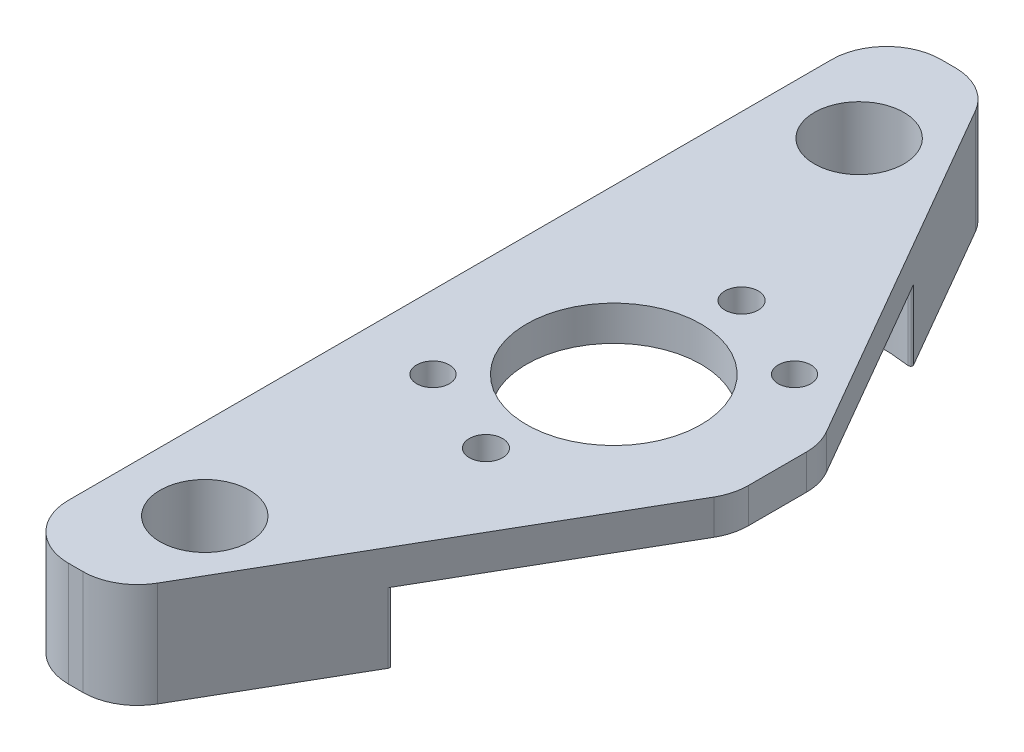
ISO-10303-21;
HEADER;
FILE_DESCRIPTION(('STEP AP214'),'2;1');
FILE_NAME('part.step','',(''),(''),'','','');
FILE_SCHEMA(('AUTOMOTIVE_DESIGN { 1 0 10303 214 1 1 1 1 }'));
ENDSEC;
DATA;
#1=APPLICATION_CONTEXT('core data for automotive mechanical design processes');
#2=APPLICATION_PROTOCOL_DEFINITION('international standard','automotive_design',2000,#1);
#3=PRODUCT_CONTEXT('',#1,'mechanical');
#4=PRODUCT('Part','Part','',(#3));
#5=PRODUCT_RELATED_PRODUCT_CATEGORY('part','',(#4));
#6=PRODUCT_DEFINITION_FORMATION('','',#4);
#7=PRODUCT_DEFINITION_CONTEXT('part definition',#1,'design');
#8=PRODUCT_DEFINITION('design','',#6,#7);
#9=PRODUCT_DEFINITION_SHAPE('','',#8);
#10=(LENGTH_UNIT() NAMED_UNIT(*) SI_UNIT(.MILLI.,.METRE.));
#11=(NAMED_UNIT(*) PLANE_ANGLE_UNIT() SI_UNIT($,.RADIAN.));
#12=(NAMED_UNIT(*) SI_UNIT($,.STERADIAN.) SOLID_ANGLE_UNIT());
#13=UNCERTAINTY_MEASURE_WITH_UNIT(LENGTH_MEASURE(1.E-05),#10,'distance_accuracy_value','');
#14=(GEOMETRIC_REPRESENTATION_CONTEXT(3) GLOBAL_UNCERTAINTY_ASSIGNED_CONTEXT((#13)) GLOBAL_UNIT_ASSIGNED_CONTEXT((#10,
#11,#12)) REPRESENTATION_CONTEXT('',''));
#15=CARTESIAN_POINT('',(0.,0.,0.));
#16=DIRECTION('',(0.,0.,1.));
#17=DIRECTION('',(1.,0.,0.));
#18=AXIS2_PLACEMENT_3D('',#15,#16,#17);
#19=CARTESIAN_POINT('',(0.,4.064,0.));
#20=DIRECTION('',(0.,-1.,0.));
#21=DIRECTION('',(0.,0.,-1.));
#22=AXIS2_PLACEMENT_3D('',#19,#20,#21);
#23=CYLINDRICAL_SURFACE('',#22,15.24);
#24=DIRECTION('',(0.,-1.,0.));
#25=VECTOR('',#24,1.);
#26=CARTESIAN_POINT('',(-9.32033057851238,4.064,12.0577376778253));
#27=LINE('',#26,#25);
#28=CARTESIAN_POINT('',(-9.32033057851238,4.064,12.0577376778253));
#29=VERTEX_POINT('',#28);
#30=CARTESIAN_POINT('',(-9.32033057851238,0.,12.0577376778253));
#31=VERTEX_POINT('',#30);
#32=EDGE_CURVE('E220',#29,#31,#27,.T.);
#33=ORIENTED_EDGE('',*,*,#32,.F.);
#34=CARTESIAN_POINT('',(0.,4.064,0.));
#35=DIRECTION('',(0.,-1.,0.));
#36=DIRECTION('',(0.,0.,-1.));
#37=AXIS2_PLACEMENT_3D('',#34,#35,#36);
#38=CIRCLE('',#37,15.24);
#39=CARTESIAN_POINT('',(2.03518826968259,4.064,15.1034965722162));
#40=VERTEX_POINT('',#39);
#41=EDGE_CURVE('E313',#29,#40,#38,.F.);
#42=ORIENTED_EDGE('',*,*,#41,.T.);
#43=DIRECTION('',(0.,-1.,0.));
#44=VECTOR('',#43,1.);
#45=CARTESIAN_POINT('',(2.03518826968259,4.064,15.1034965722162));
#46=LINE('',#45,#44);
#47=CARTESIAN_POINT('',(2.03518826968259,0.,15.1034965722162));
#48=VERTEX_POINT('',#47);
#49=EDGE_CURVE('E221',#48,#40,#46,.F.);
#50=ORIENTED_EDGE('',*,*,#49,.F.);
#51=CARTESIAN_POINT('',(0.,0.,0.));
#52=DIRECTION('',(0.,-1.,0.));
#53=DIRECTION('',(0.,0.,-1.));
#54=AXIS2_PLACEMENT_3D('',#51,#52,#53);
#55=CIRCLE('',#54,15.24);
#56=EDGE_CURVE('E318',#48,#31,#55,.T.);
#57=ORIENTED_EDGE('',*,*,#56,.T.);
#58=EDGE_LOOP('',(#33,#42,#50,#57));
#59=FACE_BOUND('',#58,.T.);
#60=ADVANCED_FACE('F17',(#59),#23,.F.);
#61=CARTESIAN_POINT('',(0.,4.064,0.));
#62=DIRECTION('',(0.,-1.,0.));
#63=DIRECTION('',(0.,0.,-1.));
#64=AXIS2_PLACEMENT_3D('',#61,#62,#63);
#65=CYLINDRICAL_SURFACE('',#64,15.24);
#66=CARTESIAN_POINT('',(0.,4.064,0.));
#67=DIRECTION('',(0.,-1.,0.));
#68=DIRECTION('',(0.,0.,-1.));
#69=AXIS2_PLACEMENT_3D('',#66,#67,#68);
#70=CIRCLE('',#69,15.24);
#71=CARTESIAN_POINT('',(2.03518826968258,4.064,-15.1034965722162));
#72=VERTEX_POINT('',#71);
#73=CARTESIAN_POINT('',(-9.32033057851238,4.064,-12.0577376778253));
#74=VERTEX_POINT('',#73);
#75=EDGE_CURVE('E64',#72,#74,#70,.F.);
#76=ORIENTED_EDGE('',*,*,#75,.T.);
#77=DIRECTION('',(0.,-1.,0.));
#78=VECTOR('',#77,1.);
#79=CARTESIAN_POINT('',(-9.32033057851238,4.064,-12.0577376778253));
#80=LINE('',#79,#78);
#81=CARTESIAN_POINT('',(-9.32033057851238,0.,-12.0577376778253));
#82=VERTEX_POINT('',#81);
#83=EDGE_CURVE('E179',#82,#74,#80,.F.);
#84=ORIENTED_EDGE('',*,*,#83,.F.);
#85=CARTESIAN_POINT('',(0.,0.,0.));
#86=DIRECTION('',(0.,-1.,0.));
#87=DIRECTION('',(0.,0.,-1.));
#88=AXIS2_PLACEMENT_3D('',#85,#86,#87);
#89=CIRCLE('',#88,15.24);
#90=CARTESIAN_POINT('',(2.03518826968258,0.,-15.1034965722162));
#91=VERTEX_POINT('',#90);
#92=EDGE_CURVE('E295',#82,#91,#89,.T.);
#93=ORIENTED_EDGE('',*,*,#92,.T.);
#94=DIRECTION('',(0.,-1.,0.));
#95=VECTOR('',#94,1.);
#96=CARTESIAN_POINT('',(2.03518826968258,4.064,-15.1034965722162));
#97=LINE('',#96,#95);
#98=EDGE_CURVE('E206',#72,#91,#97,.T.);
#99=ORIENTED_EDGE('',*,*,#98,.F.);
#100=EDGE_LOOP('',(#76,#84,#93,#99));
#101=FACE_BOUND('',#100,.T.);
#102=ADVANCED_FACE('F659',(#101),#65,.F.);
#103=CARTESIAN_POINT('',(2.05214817192994,4.064,-15.2293590436513));
#104=DIRECTION('',(0.,-1.,0.));
#105=DIRECTION('',(0.,0.,-1.));
#106=AXIS2_PLACEMENT_3D('',#103,#104,#105);
#107=CYLINDRICAL_SURFACE('',#106,0.127);
#108=CARTESIAN_POINT('',(2.05214817192994,4.064,-15.2293590436513));
#109=DIRECTION('',(0.,-1.,0.));
#110=DIRECTION('',(0.,0.,-1.));
#111=AXIS2_PLACEMENT_3D('',#108,#109,#110);
#112=CIRCLE('',#111,0.127);
#113=CARTESIAN_POINT('',(2.16213339821056,4.064,-15.2928590436513));
#114=VERTEX_POINT('',#113);
#115=EDGE_CURVE('E304',#114,#72,#112,.T.);
#116=ORIENTED_EDGE('',*,*,#115,.T.);
#117=ORIENTED_EDGE('',*,*,#98,.T.);
#118=CARTESIAN_POINT('',(2.05214817192994,0.,-15.2293590436513));
#119=DIRECTION('',(0.,-1.,0.));
#120=DIRECTION('',(0.,0.,-1.));
#121=AXIS2_PLACEMENT_3D('',#118,#119,#120);
#122=CIRCLE('',#121,0.127);
#123=CARTESIAN_POINT('',(2.16213339821056,0.,-15.2928590436513));
#124=VERTEX_POINT('',#123);
#125=EDGE_CURVE('E301',#91,#124,#122,.F.);
#126=ORIENTED_EDGE('',*,*,#125,.T.);
#127=DIRECTION('',(0.,1.,0.));
#128=VECTOR('',#127,1.);
#129=CARTESIAN_POINT('',(2.16213339821056,-48.4998214151962,-15.2928590436513));
#130=LINE('',#129,#128);
#131=EDGE_CURVE('E210',#124,#114,#130,.T.);
#132=ORIENTED_EDGE('',*,*,#131,.T.);
#133=EDGE_LOOP('',(#116,#117,#126,#132));
#134=FACE_BOUND('',#133,.T.);
#135=ADVANCED_FACE('F427',(#134),#107,.T.);
#136=CARTESIAN_POINT('',(9.52500000000001,6.096,-25.4));
#137=DIRECTION('',(0.,0.,1.));
#138=DIRECTION('',(1.,0.,0.));
#139=AXIS2_PLACEMENT_3D('',#136,#137,#138);
#140=PLANE('',#139);
#141=DIRECTION('',(0.,-1.,0.));
#142=VECTOR('',#141,1.);
#143=CARTESIAN_POINT('',(-5.5063142583519,6.096,-25.4));
#144=LINE('',#143,#142);
#145=CARTESIAN_POINT('',(-5.5063142583519,0.,-25.4));
#146=VERTEX_POINT('',#145);
#147=CARTESIAN_POINT('',(-5.5063142583519,6.096,-25.4));
#148=VERTEX_POINT('',#147);
#149=EDGE_CURVE('E288',#146,#148,#144,.F.);
#150=ORIENTED_EDGE('',*,*,#149,.F.);
#151=DIRECTION('',(1.,0.,0.));
#152=VECTOR('',#151,1.);
#153=CARTESIAN_POINT('',(-9.52499999999999,0.,-25.4));
#154=LINE('',#153,#152);
#155=CARTESIAN_POINT('',(-6.34999999999999,0.,-25.4));
#156=VERTEX_POINT('',#155);
#157=EDGE_CURVE('E300',#146,#156,#154,.F.);
#158=ORIENTED_EDGE('',*,*,#157,.T.);
#159=DIRECTION('',(0.,-1.,0.));
#160=VECTOR('',#159,1.);
#161=CARTESIAN_POINT('',(-6.34999999999999,6.096,-25.4));
#162=LINE('',#161,#160);
#163=CARTESIAN_POINT('',(-6.34999999999999,6.096,-25.4));
#164=VERTEX_POINT('',#163);
#165=EDGE_CURVE('E284',#164,#156,#162,.T.);
#166=ORIENTED_EDGE('',*,*,#165,.F.);
#167=DIRECTION('',(1.,0.,0.));
#168=VECTOR('',#167,1.);
#169=CARTESIAN_POINT('',(9.52500000000001,6.096,-25.4));
#170=LINE('',#169,#168);
#171=EDGE_CURVE('E204',#148,#164,#170,.F.);
#172=ORIENTED_EDGE('',*,*,#171,.F.);
#173=EDGE_LOOP('',(#150,#158,#166,#172));
#174=FACE_BOUND('',#173,.T.);
#175=ADVANCED_FACE('F389',(#174),#140,.F.);
#176=CARTESIAN_POINT('',(-9.39799999999998,4.064,12.1582188251405));
#177=DIRECTION('',(0.,-1.,0.));
#178=DIRECTION('',(0.,0.,-1.));
#179=AXIS2_PLACEMENT_3D('',#176,#177,#178);
#180=CYLINDRICAL_SURFACE('',#179,0.127);
#181=CARTESIAN_POINT('',(-9.39799999999998,0.,12.1582188251405));
#182=DIRECTION('',(0.,-1.,0.));
#183=DIRECTION('',(0.,0.,-1.));
#184=AXIS2_PLACEMENT_3D('',#181,#182,#183);
#185=CIRCLE('',#184,0.127);
#186=CARTESIAN_POINT('',(-9.52499999999999,0.,12.1582188251405));
#187=VERTEX_POINT('',#186);
#188=EDGE_CURVE('E56',#31,#187,#185,.F.);
#189=ORIENTED_EDGE('',*,*,#188,.T.);
#190=DIRECTION('',(0.,1.,0.));
#191=VECTOR('',#190,1.);
#192=CARTESIAN_POINT('',(-9.52499999999999,6.096,12.1582188251405));
#193=LINE('',#192,#191);
#194=CARTESIAN_POINT('',(-9.52499999999999,4.064,12.1582188251405));
#195=VERTEX_POINT('',#194);
#196=EDGE_CURVE('E167',#187,#195,#193,.T.);
#197=ORIENTED_EDGE('',*,*,#196,.T.);
#198=CARTESIAN_POINT('',(-9.39799999999998,4.064,12.1582188251405));
#199=DIRECTION('',(0.,-1.,0.));
#200=DIRECTION('',(0.,0.,-1.));
#201=AXIS2_PLACEMENT_3D('',#198,#199,#200);
#202=CIRCLE('',#201,0.127);
#203=EDGE_CURVE('E181',#195,#29,#202,.T.);
#204=ORIENTED_EDGE('',*,*,#203,.T.);
#205=ORIENTED_EDGE('',*,*,#32,.T.);
#206=EDGE_LOOP('',(#189,#197,#204,#205));
#207=FACE_BOUND('',#206,.T.);
#208=ADVANCED_FACE('F418',(#207),#180,.T.);
#209=CARTESIAN_POINT('',(-9.39799999999998,4.064,-12.1582188251405));
#210=DIRECTION('',(0.,-1.,0.));
#211=DIRECTION('',(0.,0.,-1.));
#212=AXIS2_PLACEMENT_3D('',#209,#210,#211);
#213=CYLINDRICAL_SURFACE('',#212,0.127);
#214=CARTESIAN_POINT('',(-9.39799999999998,0.,-12.1582188251405));
#215=DIRECTION('',(0.,-1.,0.));
#216=DIRECTION('',(0.,0.,-1.));
#217=AXIS2_PLACEMENT_3D('',#214,#215,#216);
#218=CIRCLE('',#217,0.127);
#219=CARTESIAN_POINT('',(-9.52499999999999,0.,-12.1582188251405));
#220=VERTEX_POINT('',#219);
#221=EDGE_CURVE('E298',#220,#82,#218,.F.);
#222=ORIENTED_EDGE('',*,*,#221,.T.);
#223=ORIENTED_EDGE('',*,*,#83,.T.);
#224=CARTESIAN_POINT('',(-9.39799999999998,4.064,-12.1582188251405));
#225=DIRECTION('',(0.,-1.,0.));
#226=DIRECTION('',(0.,0.,-1.));
#227=AXIS2_PLACEMENT_3D('',#224,#225,#226);
#228=CIRCLE('',#227,0.127);
#229=CARTESIAN_POINT('',(-9.52499999999999,4.064,-12.1582188251405));
#230=VERTEX_POINT('',#229);
#231=EDGE_CURVE('E172',#74,#230,#228,.T.);
#232=ORIENTED_EDGE('',*,*,#231,.T.);
#233=DIRECTION('',(0.,1.,0.));
#234=VECTOR('',#233,1.);
#235=CARTESIAN_POINT('',(-9.52499999999999,6.096,-12.1582188251405));
#236=LINE('',#235,#234);
#237=EDGE_CURVE('E177',#230,#220,#236,.F.);
#238=ORIENTED_EDGE('',*,*,#237,.T.);
#239=EDGE_LOOP('',(#222,#223,#232,#238));
#240=FACE_BOUND('',#239,.T.);
#241=ADVANCED_FACE('F175',(#240),#213,.T.);
#242=CARTESIAN_POINT('',(-9.52499999999999,6.096,25.4));
#243=DIRECTION('',(0.,0.,-1.));
#244=DIRECTION('',(-1.,0.,0.));
#245=AXIS2_PLACEMENT_3D('',#242,#243,#244);
#246=PLANE('',#245);
#247=DIRECTION('',(0.,1.,0.));
#248=VECTOR('',#247,1.);
#249=CARTESIAN_POINT('',(-5.50631425835189,6.096,25.4));
#250=LINE('',#249,#248);
#251=CARTESIAN_POINT('',(-5.50631425835189,6.096,25.4));
#252=VERTEX_POINT('',#251);
#253=CARTESIAN_POINT('',(-5.50631425835189,0.,25.4));
#254=VERTEX_POINT('',#253);
#255=EDGE_CURVE('E276',#252,#254,#250,.F.);
#256=ORIENTED_EDGE('',*,*,#255,.F.);
#257=DIRECTION('',(-1.,0.,0.));
#258=VECTOR('',#257,1.);
#259=CARTESIAN_POINT('',(-9.52499999999999,6.096,25.4));
#260=LINE('',#259,#258);
#261=CARTESIAN_POINT('',(-6.34999999999999,6.096,25.4));
#262=VERTEX_POINT('',#261);
#263=EDGE_CURVE('E218',#262,#252,#260,.F.);
#264=ORIENTED_EDGE('',*,*,#263,.F.);
#265=DIRECTION('',(0.,-1.,0.));
#266=VECTOR('',#265,1.);
#267=CARTESIAN_POINT('',(-6.34999999999999,6.096,25.4));
#268=LINE('',#267,#266);
#269=CARTESIAN_POINT('',(-6.34999999999999,0.,25.4));
#270=VERTEX_POINT('',#269);
#271=EDGE_CURVE('E277',#270,#262,#268,.F.);
#272=ORIENTED_EDGE('',*,*,#271,.F.);
#273=DIRECTION('',(1.,0.,0.));
#274=VECTOR('',#273,1.);
#275=CARTESIAN_POINT('',(-9.52499999999999,0.,25.4));
#276=LINE('',#275,#274);
#277=EDGE_CURVE('E322',#270,#254,#276,.T.);
#278=ORIENTED_EDGE('',*,*,#277,.T.);
#279=EDGE_LOOP('',(#256,#264,#272,#278));
#280=FACE_BOUND('',#279,.T.);
#281=ADVANCED_FACE('F401',(#280),#246,.F.);
#282=CARTESIAN_POINT('',(2.05214817192994,4.064,15.2293590436513));
#283=DIRECTION('',(0.,-1.,0.));
#284=DIRECTION('',(0.,0.,-1.));
#285=AXIS2_PLACEMENT_3D('',#282,#283,#284);
#286=CYLINDRICAL_SURFACE('',#285,0.127);
#287=DIRECTION('',(0.,1.,0.));
#288=VECTOR('',#287,1.);
#289=CARTESIAN_POINT('',(2.16213339821056,-48.4998214151962,15.2928590436513));
#290=LINE('',#289,#288);
#291=CARTESIAN_POINT('',(2.16213339821056,4.06400000000002,15.2928590436513));
#292=VERTEX_POINT('',#291);
#293=CARTESIAN_POINT('',(2.16213339821056,0.,15.2928590436513));
#294=VERTEX_POINT('',#293);
#295=EDGE_CURVE('E330',#292,#294,#290,.F.);
#296=ORIENTED_EDGE('',*,*,#295,.T.);
#297=CARTESIAN_POINT('',(2.05214817192994,0.,15.2293590436513));
#298=DIRECTION('',(0.,-1.,0.));
#299=DIRECTION('',(0.,0.,-1.));
#300=AXIS2_PLACEMENT_3D('',#297,#298,#299);
#301=CIRCLE('',#300,0.127);
#302=EDGE_CURVE('E321',#294,#48,#301,.F.);
#303=ORIENTED_EDGE('',*,*,#302,.T.);
#304=ORIENTED_EDGE('',*,*,#49,.T.);
#305=CARTESIAN_POINT('',(2.05214817192994,4.064,15.2293590436513));
#306=DIRECTION('',(0.,-1.,0.));
#307=DIRECTION('',(0.,0.,-1.));
#308=AXIS2_PLACEMENT_3D('',#305,#306,#307);
#309=CIRCLE('',#308,0.127);
#310=EDGE_CURVE('E311',#40,#292,#309,.T.);
#311=ORIENTED_EDGE('',*,*,#310,.T.);
#312=EDGE_LOOP('',(#296,#303,#304,#311));
#313=FACE_BOUND('',#312,.T.);
#314=ADVANCED_FACE('F412',(#313),#286,.T.);
#315=CARTESIAN_POINT('',(6.35000000000001,6.096,-1.68926131403118));
#316=DIRECTION('',(0.,1.,0.));
#317=DIRECTION('',(0.,0.,1.));
#318=AXIS2_PLACEMENT_3D('',#315,#316,#317);
#319=CYLINDRICAL_SURFACE('',#318,3.175);
#320=CARTESIAN_POINT('',(6.35000000000001,6.096,-1.68926131403118));
#321=DIRECTION('',(0.,1.,0.));
#322=DIRECTION('',(0.,0.,1.));
#323=AXIS2_PLACEMENT_3D('',#320,#321,#322);
#324=CIRCLE('',#323,3.175);
#325=CARTESIAN_POINT('',(9.09963065701561,6.096,-3.27676131403118));
#326=VERTEX_POINT('',#325);
#327=CARTESIAN_POINT('',(9.52500000000001,6.096,-1.68926131403118));
#328=VERTEX_POINT('',#327);
#329=EDGE_CURVE('E20',#326,#328,#324,.F.);
#330=ORIENTED_EDGE('',*,*,#329,.T.);
#331=DIRECTION('',(0.,1.,0.));
#332=VECTOR('',#331,1.);
#333=CARTESIAN_POINT('',(9.52500000000001,6.096,-1.68926131403118));
#334=LINE('',#333,#332);
#335=CARTESIAN_POINT('',(9.52500000000001,4.064,-1.68926131403118));
#336=VERTEX_POINT('',#335);
#337=EDGE_CURVE('E335',#328,#336,#334,.F.);
#338=ORIENTED_EDGE('',*,*,#337,.T.);
#339=CARTESIAN_POINT('',(6.35000000000001,4.064,-1.68926131403118));
#340=DIRECTION('',(0.,1.,0.));
#341=DIRECTION('',(0.,0.,1.));
#342=AXIS2_PLACEMENT_3D('',#339,#340,#341);
#343=CIRCLE('',#342,3.175);
#344=CARTESIAN_POINT('',(9.0996306570156,4.064,-3.27676131403118));
#345=VERTEX_POINT('',#344);
#346=EDGE_CURVE('E307',#336,#345,#343,.T.);
#347=ORIENTED_EDGE('',*,*,#346,.T.);
#348=DIRECTION('',(0.,1.,0.));
#349=VECTOR('',#348,1.);
#350=CARTESIAN_POINT('',(9.0996306570156,-48.4998214151962,-3.27676131403118));
#351=LINE('',#350,#349);
#352=EDGE_CURVE('E211',#345,#326,#351,.T.);
#353=ORIENTED_EDGE('',*,*,#352,.T.);
#354=EDGE_LOOP('',(#330,#338,#347,#353));
#355=FACE_BOUND('',#354,.T.);
#356=ADVANCED_FACE('F374',(#355),#319,.T.);
#357=CARTESIAN_POINT('',(6.35000000000001,6.096,1.68926131403118));
#358=DIRECTION('',(0.,-1.,0.));
#359=DIRECTION('',(0.,0.,-1.));
#360=AXIS2_PLACEMENT_3D('',#357,#358,#359);
#361=CYLINDRICAL_SURFACE('',#360,3.175);
#362=CARTESIAN_POINT('',(6.35000000000001,6.096,1.68926131403118));
#363=DIRECTION('',(0.,-1.,0.));
#364=DIRECTION('',(0.,0.,-1.));
#365=AXIS2_PLACEMENT_3D('',#362,#363,#364);
#366=CIRCLE('',#365,3.175);
#367=CARTESIAN_POINT('',(9.52500000000001,6.096,1.68926131403118));
#368=VERTEX_POINT('',#367);
#369=CARTESIAN_POINT('',(9.09963065701561,6.096,3.27676131403118));
#370=VERTEX_POINT('',#369);
#371=EDGE_CURVE('E84',#368,#370,#366,.T.);
#372=ORIENTED_EDGE('',*,*,#371,.T.);
#373=DIRECTION('',(0.,1.,0.));
#374=VECTOR('',#373,1.);
#375=CARTESIAN_POINT('',(9.09963065701561,-48.4998214151962,3.27676131403118));
#376=LINE('',#375,#374);
#377=CARTESIAN_POINT('',(9.09963065701561,4.06400000000001,3.27676131403118));
#378=VERTEX_POINT('',#377);
#379=EDGE_CURVE('E331',#370,#378,#376,.F.);
#380=ORIENTED_EDGE('',*,*,#379,.T.);
#381=CARTESIAN_POINT('',(6.35000000000001,4.064,1.68926131403118));
#382=DIRECTION('',(0.,-1.,0.));
#383=DIRECTION('',(0.,0.,-1.));
#384=AXIS2_PLACEMENT_3D('',#381,#382,#383);
#385=CIRCLE('',#384,3.175);
#386=CARTESIAN_POINT('',(9.52500000000001,4.064,1.68926131403118));
#387=VERTEX_POINT('',#386);
#388=EDGE_CURVE('E309',#378,#387,#385,.F.);
#389=ORIENTED_EDGE('',*,*,#388,.T.);
#390=DIRECTION('',(0.,1.,0.));
#391=VECTOR('',#390,1.);
#392=CARTESIAN_POINT('',(9.52500000000001,6.096,1.68926131403118));
#393=LINE('',#392,#391);
#394=EDGE_CURVE('E273',#387,#368,#393,.T.);
#395=ORIENTED_EDGE('',*,*,#394,.T.);
#396=EDGE_LOOP('',(#372,#380,#389,#395));
#397=FACE_BOUND('',#396,.T.);
#398=ADVANCED_FACE('F409',(#397),#361,.T.);
#399=CARTESIAN_POINT('',(-9.52499999999999,0.,25.4));
#400=DIRECTION('',(0.,1.,0.));
#401=DIRECTION('',(0.,0.,1.));
#402=AXIS2_PLACEMENT_3D('',#399,#400,#401);
#403=PLANE('',#402);
#404=ORIENTED_EDGE('',*,*,#188,.F.);
#405=ORIENTED_EDGE('',*,*,#56,.F.);
#406=ORIENTED_EDGE('',*,*,#302,.F.);
#407=DIRECTION('',(-0.5,0.,0.866025403784439));
#408=VECTOR('',#407,1.);
#409=CARTESIAN_POINT('',(9.52500000000001,0.,2.54));
#410=LINE('',#409,#408);
#411=CARTESIAN_POINT('',(-2.75668360133629,0.,23.8125));
#412=VERTEX_POINT('',#411);
#413=EDGE_CURVE('E332',#294,#412,#410,.T.);
#414=ORIENTED_EDGE('',*,*,#413,.T.);
#415=CARTESIAN_POINT('',(-5.50631425835189,0.,22.225));
#416=DIRECTION('',(0.,1.,0.));
#417=DIRECTION('',(0.,0.,1.));
#418=AXIS2_PLACEMENT_3D('',#415,#416,#417);
#419=CIRCLE('',#418,3.175);
#420=EDGE_CURVE('E274',#254,#412,#419,.T.);
#421=ORIENTED_EDGE('',*,*,#420,.F.);
#422=ORIENTED_EDGE('',*,*,#277,.F.);
#423=CARTESIAN_POINT('',(-6.34999999999999,0.,22.225));
#424=DIRECTION('',(0.,-1.,0.));
#425=DIRECTION('',(0.,0.,-1.));
#426=AXIS2_PLACEMENT_3D('',#423,#424,#425);
#427=CIRCLE('',#426,3.175);
#428=CARTESIAN_POINT('',(-9.52499999999999,0.,22.225));
#429=VERTEX_POINT('',#428);
#430=EDGE_CURVE('E278',#429,#270,#427,.F.);
#431=ORIENTED_EDGE('',*,*,#430,.F.);
#432=DIRECTION('',(0.,0.,-1.));
#433=VECTOR('',#432,1.);
#434=CARTESIAN_POINT('',(-9.52499999999999,0.,-25.4));
#435=LINE('',#434,#433);
#436=EDGE_CURVE('E200',#429,#187,#435,.T.);
#437=ORIENTED_EDGE('',*,*,#436,.T.);
#438=EDGE_LOOP('',(#404,#405,#406,#414,#421,#422,#431,#437));
#439=FACE_BOUND('',#438,.T.);
#440=CARTESIAN_POINT('',(-4.76249999999999,0.,19.05));
#441=DIRECTION('',(0.,1.,0.));
#442=DIRECTION('',(0.,0.,1.));
#443=AXIS2_PLACEMENT_3D('',#440,#441,#442);
#444=CIRCLE('',#443,2.6035);
#445=CARTESIAN_POINT('',(-4.76249999999999,0.,21.6535));
#446=VERTEX_POINT('',#445);
#447=EDGE_CURVE('E270',#446,#446,#444,.T.);
#448=ORIENTED_EDGE('',*,*,#447,.T.);
#449=EDGE_LOOP('',(#448));
#450=FACE_BOUND('',#449,.T.);
#451=ADVANCED_FACE('F414',(#439,#450),#403,.F.);
#452=CARTESIAN_POINT('',(0.,4.064,0.));
#453=DIRECTION('',(0.,1.,0.));
#454=DIRECTION('',(0.,0.,1.));
#455=AXIS2_PLACEMENT_3D('',#452,#453,#454);
#456=PLANE('',#455);
#457=ORIENTED_EDGE('',*,*,#115,.F.);
#458=DIRECTION('',(0.5,0.,0.866025403784439));
#459=VECTOR('',#458,1.);
#460=CARTESIAN_POINT('',(-3.67322715367483,4.064,-25.4));
#461=LINE('',#460,#459);
#462=EDGE_CURVE('E213',#114,#345,#461,.T.);
#463=ORIENTED_EDGE('',*,*,#462,.T.);
#464=ORIENTED_EDGE('',*,*,#346,.F.);
#465=DIRECTION('',(0.,0.,1.));
#466=VECTOR('',#465,1.);
#467=CARTESIAN_POINT('',(9.52500000000001,4.064,25.4));
#468=LINE('',#467,#466);
#469=EDGE_CURVE('E337',#336,#387,#468,.T.);
#470=ORIENTED_EDGE('',*,*,#469,.T.);
#471=ORIENTED_EDGE('',*,*,#388,.F.);
#472=DIRECTION('',(-0.5,0.,0.866025403784439));
#473=VECTOR('',#472,1.);
#474=CARTESIAN_POINT('',(9.52500000000001,4.06400000000003,2.54));
#475=LINE('',#474,#473);
#476=EDGE_CURVE('E327',#378,#292,#475,.T.);
#477=ORIENTED_EDGE('',*,*,#476,.T.);
#478=ORIENTED_EDGE('',*,*,#310,.F.);
#479=ORIENTED_EDGE('',*,*,#41,.F.);
#480=ORIENTED_EDGE('',*,*,#203,.F.);
#481=DIRECTION('',(0.,0.,-1.));
#482=VECTOR('',#481,1.);
#483=CARTESIAN_POINT('',(-9.52499999999999,4.064,-25.4));
#484=LINE('',#483,#482);
#485=EDGE_CURVE('E184',#195,#230,#484,.T.);
#486=ORIENTED_EDGE('',*,*,#485,.T.);
#487=ORIENTED_EDGE('',*,*,#231,.F.);
#488=ORIENTED_EDGE('',*,*,#75,.F.);
#489=EDGE_LOOP('',(#457,#463,#464,#470,#471,#477,#478,#479,#480,#486,#487,#488));
#490=FACE_BOUND('',#489,.T.);
#491=CARTESIAN_POINT('',(0.,4.064,0.));
#492=DIRECTION('',(0.,-1.,0.));
#493=DIRECTION('',(0.,0.,-1.));
#494=AXIS2_PLACEMENT_3D('',#491,#492,#493);
#495=CIRCLE('',#494,5.08);
#496=CARTESIAN_POINT('',(0.,4.064,-5.08));
#497=VERTEX_POINT('',#496);
#498=EDGE_CURVE('E261',#497,#497,#495,.F.);
#499=ORIENTED_EDGE('',*,*,#498,.T.);
#500=EDGE_LOOP('',(#499));
#501=FACE_BOUND('',#500,.T.);
#502=CARTESIAN_POINT('',(0.,4.064,7.4422));
#503=DIRECTION('',(0.,-1.,0.));
#504=DIRECTION('',(0.,0.,-1.));
#505=AXIS2_PLACEMENT_3D('',#502,#503,#504);
#506=CIRCLE('',#505,0.97028);
#507=CARTESIAN_POINT('',(0.,4.064,6.47192));
#508=VERTEX_POINT('',#507);
#509=EDGE_CURVE('E267',#508,#508,#506,.F.);
#510=ORIENTED_EDGE('',*,*,#509,.T.);
#511=EDGE_LOOP('',(#510));
#512=FACE_BOUND('',#511,.T.);
#513=CARTESIAN_POINT('',(0.,4.064,-7.4422));
#514=DIRECTION('',(0.,-1.,0.));
#515=DIRECTION('',(0.,0.,-1.));
#516=AXIS2_PLACEMENT_3D('',#513,#514,#515);
#517=CIRCLE('',#516,0.97028);
#518=CARTESIAN_POINT('',(0.,4.064,-8.41248));
#519=VERTEX_POINT('',#518);
#520=EDGE_CURVE('E264',#519,#519,#517,.F.);
#521=ORIENTED_EDGE('',*,*,#520,.T.);
#522=EDGE_LOOP('',(#521));
#523=FACE_BOUND('',#522,.T.);
#524=CARTESIAN_POINT('',(-5.26243008694653,4.064,5.26243008694651));
#525=DIRECTION('',(0.,1.,0.));
#526=DIRECTION('',(0.,0.,1.));
#527=AXIS2_PLACEMENT_3D('',#524,#525,#526);
#528=CIRCLE('',#527,0.9525);
#529=CARTESIAN_POINT('',(-5.26243008694653,4.064,6.21493008694651));
#530=VERTEX_POINT('',#529);
#531=EDGE_CURVE('E289',#530,#530,#528,.T.);
#532=ORIENTED_EDGE('',*,*,#531,.T.);
#533=EDGE_LOOP('',(#532));
#534=FACE_BOUND('',#533,.T.);
#535=CARTESIAN_POINT('',(5.26243008694653,4.064,-5.26243008694651));
#536=DIRECTION('',(0.,1.,0.));
#537=DIRECTION('',(0.,0.,1.));
#538=AXIS2_PLACEMENT_3D('',#535,#536,#537);
#539=CIRCLE('',#538,0.9525);
#540=CARTESIAN_POINT('',(5.26243008694653,4.064,-4.30993008694651));
#541=VERTEX_POINT('',#540);
#542=EDGE_CURVE('E292',#541,#541,#539,.T.);
#543=ORIENTED_EDGE('',*,*,#542,.T.);
#544=EDGE_LOOP('',(#543));
#545=FACE_BOUND('',#544,.T.);
#546=ADVANCED_FACE('F186',(#490,#501,#512,#523,#534,#545),#456,.F.);
#547=CARTESIAN_POINT('',(-9.52499999999999,0.,25.4));
#548=DIRECTION('',(0.,1.,0.));
#549=DIRECTION('',(0.,0.,1.));
#550=AXIS2_PLACEMENT_3D('',#547,#548,#549);
#551=PLANE('',#550);
#552=ORIENTED_EDGE('',*,*,#92,.F.);
#553=ORIENTED_EDGE('',*,*,#221,.F.);
#554=DIRECTION('',(0.,0.,-1.));
#555=VECTOR('',#554,1.);
#556=CARTESIAN_POINT('',(-9.52499999999999,0.,-25.4));
#557=LINE('',#556,#555);
#558=CARTESIAN_POINT('',(-9.52499999999999,0.,-22.225));
#559=VERTEX_POINT('',#558);
#560=EDGE_CURVE('E195',#220,#559,#557,.T.);
#561=ORIENTED_EDGE('',*,*,#560,.T.);
#562=CARTESIAN_POINT('',(-6.34999999999999,0.,-22.225));
#563=DIRECTION('',(0.,-1.,0.));
#564=DIRECTION('',(0.,0.,-1.));
#565=AXIS2_PLACEMENT_3D('',#562,#563,#564);
#566=CIRCLE('',#565,3.175);
#567=EDGE_CURVE('E281',#156,#559,#566,.F.);
#568=ORIENTED_EDGE('',*,*,#567,.F.);
#569=ORIENTED_EDGE('',*,*,#157,.F.);
#570=CARTESIAN_POINT('',(-5.5063142583519,0.,-22.225));
#571=DIRECTION('',(0.,-1.,0.));
#572=DIRECTION('',(0.,0.,-1.));
#573=AXIS2_PLACEMENT_3D('',#570,#571,#572);
#574=CIRCLE('',#573,3.175);
#575=CARTESIAN_POINT('',(-2.7566836013363,0.,-23.8125));
#576=VERTEX_POINT('',#575);
#577=EDGE_CURVE('E285',#576,#146,#574,.F.);
#578=ORIENTED_EDGE('',*,*,#577,.F.);
#579=DIRECTION('',(0.5,0.,0.866025403784439));
#580=VECTOR('',#579,1.);
#581=CARTESIAN_POINT('',(-3.67322715367483,0.,-25.4));
#582=LINE('',#581,#580);
#583=EDGE_CURVE('E207',#576,#124,#582,.T.);
#584=ORIENTED_EDGE('',*,*,#583,.T.);
#585=ORIENTED_EDGE('',*,*,#125,.F.);
#586=EDGE_LOOP('',(#552,#553,#561,#568,#569,#578,#584,#585));
#587=FACE_BOUND('',#586,.T.);
#588=CARTESIAN_POINT('',(-4.76249999999999,0.,-19.05));
#589=DIRECTION('',(0.,1.,0.));
#590=DIRECTION('',(0.,0.,1.));
#591=AXIS2_PLACEMENT_3D('',#588,#589,#590);
#592=CIRCLE('',#591,2.6035);
#593=CARTESIAN_POINT('',(-4.76249999999999,0.,-16.4465));
#594=VERTEX_POINT('',#593);
#595=EDGE_CURVE('E258',#594,#594,#592,.T.);
#596=ORIENTED_EDGE('',*,*,#595,.T.);
#597=EDGE_LOOP('',(#596));
#598=FACE_BOUND('',#597,.T.);
#599=ADVANCED_FACE('F479',(#587,#598),#551,.F.);
#600=CARTESIAN_POINT('',(5.26243008694653,0.,-5.26243008694651));
#601=DIRECTION('',(0.,1.,0.));
#602=DIRECTION('',(0.,0.,1.));
#603=AXIS2_PLACEMENT_3D('',#600,#601,#602);
#604=CYLINDRICAL_SURFACE('',#603,0.9525);
#605=CARTESIAN_POINT('',(5.26243008694653,6.096,-5.26243008694651));
#606=DIRECTION('',(0.,1.,0.));
#607=DIRECTION('',(0.,0.,1.));
#608=AXIS2_PLACEMENT_3D('',#605,#606,#607);
#609=CIRCLE('',#608,0.9525);
#610=CARTESIAN_POINT('',(5.26243008694653,6.096,-4.30993008694651));
#611=VERTEX_POINT('',#610);
#612=EDGE_CURVE('E255',#611,#611,#609,.F.);
#613=ORIENTED_EDGE('',*,*,#612,.F.);
#614=EDGE_LOOP('',(#613));
#615=FACE_BOUND('',#614,.T.);
#616=ORIENTED_EDGE('',*,*,#542,.F.);
#617=EDGE_LOOP('',(#616));
#618=FACE_BOUND('',#617,.T.);
#619=ADVANCED_FACE('F475',(#615,#618),#604,.F.);
#620=CARTESIAN_POINT('',(-5.26243008694653,0.,5.26243008694651));
#621=DIRECTION('',(0.,1.,0.));
#622=DIRECTION('',(0.,0.,1.));
#623=AXIS2_PLACEMENT_3D('',#620,#621,#622);
#624=CYLINDRICAL_SURFACE('',#623,0.9525);
#625=CARTESIAN_POINT('',(-5.26243008694653,6.096,5.26243008694651));
#626=DIRECTION('',(0.,1.,0.));
#627=DIRECTION('',(0.,0.,1.));
#628=AXIS2_PLACEMENT_3D('',#625,#626,#627);
#629=CIRCLE('',#628,0.9525);
#630=CARTESIAN_POINT('',(-5.26243008694653,6.096,6.21493008694651));
#631=VERTEX_POINT('',#630);
#632=EDGE_CURVE('E252',#631,#631,#629,.F.);
#633=ORIENTED_EDGE('',*,*,#632,.F.);
#634=EDGE_LOOP('',(#633));
#635=FACE_BOUND('',#634,.T.);
#636=ORIENTED_EDGE('',*,*,#531,.F.);
#637=EDGE_LOOP('',(#636));
#638=FACE_BOUND('',#637,.T.);
#639=ADVANCED_FACE('F472',(#635,#638),#624,.F.);
#640=CARTESIAN_POINT('',(-3.67322715367483,-48.4998214151962,-25.4));
#641=DIRECTION('',(-0.866025403784439,0.,0.5));
#642=DIRECTION('',(0.5,0.,0.866025403784439));
#643=AXIS2_PLACEMENT_3D('',#640,#641,#642);
#644=PLANE('',#643);
#645=ORIENTED_EDGE('',*,*,#131,.F.);
#646=ORIENTED_EDGE('',*,*,#583,.F.);
#647=DIRECTION('',(0.,-1.,0.));
#648=VECTOR('',#647,1.);
#649=CARTESIAN_POINT('',(-2.7566836013363,6.096,-23.8125));
#650=LINE('',#649,#648);
#651=CARTESIAN_POINT('',(-2.7566836013363,6.096,-23.8125));
#652=VERTEX_POINT('',#651);
#653=EDGE_CURVE('E216',#652,#576,#650,.T.);
#654=ORIENTED_EDGE('',*,*,#653,.F.);
#655=DIRECTION('',(-0.5,0.,-0.866025403784439));
#656=VECTOR('',#655,1.);
#657=CARTESIAN_POINT('',(9.09963065701561,6.096,-3.27676131403118));
#658=LINE('',#657,#656);
#659=EDGE_CURVE('E251',#326,#652,#658,.T.);
#660=ORIENTED_EDGE('',*,*,#659,.F.);
#661=ORIENTED_EDGE('',*,*,#352,.F.);
#662=ORIENTED_EDGE('',*,*,#462,.F.);
#663=EDGE_LOOP('',(#645,#646,#654,#660,#661,#662));
#664=FACE_BOUND('',#663,.T.);
#665=ADVANCED_FACE('F381',(#664),#644,.F.);
#666=CARTESIAN_POINT('',(-5.5063142583519,6.096,-22.225));
#667=DIRECTION('',(0.,-1.,0.));
#668=DIRECTION('',(0.,0.,-1.));
#669=AXIS2_PLACEMENT_3D('',#666,#667,#668);
#670=CYLINDRICAL_SURFACE('',#669,3.175);
#671=ORIENTED_EDGE('',*,*,#577,.T.);
#672=ORIENTED_EDGE('',*,*,#149,.T.);
#673=CARTESIAN_POINT('',(-5.5063142583519,6.096,-22.225));
#674=DIRECTION('',(0.,-1.,0.));
#675=DIRECTION('',(0.,0.,-1.));
#676=AXIS2_PLACEMENT_3D('',#673,#674,#675);
#677=CIRCLE('',#676,3.175);
#678=EDGE_CURVE('E248',#652,#148,#677,.F.);
#679=ORIENTED_EDGE('',*,*,#678,.F.);
#680=ORIENTED_EDGE('',*,*,#653,.T.);
#681=EDGE_LOOP('',(#671,#672,#679,#680));
#682=FACE_BOUND('',#681,.T.);
#683=ADVANCED_FACE('F385',(#682),#670,.T.);
#684=CARTESIAN_POINT('',(-6.34999999999999,6.096,-22.225));
#685=DIRECTION('',(0.,-1.,0.));
#686=DIRECTION('',(0.,0.,-1.));
#687=AXIS2_PLACEMENT_3D('',#684,#685,#686);
#688=CYLINDRICAL_SURFACE('',#687,3.175);
#689=ORIENTED_EDGE('',*,*,#567,.T.);
#690=DIRECTION('',(0.,1.,0.));
#691=VECTOR('',#690,1.);
#692=CARTESIAN_POINT('',(-9.52499999999999,6.096,-22.225));
#693=LINE('',#692,#691);
#694=CARTESIAN_POINT('',(-9.52499999999999,6.096,-22.225));
#695=VERTEX_POINT('',#694);
#696=EDGE_CURVE('E283',#559,#695,#693,.T.);
#697=ORIENTED_EDGE('',*,*,#696,.T.);
#698=CARTESIAN_POINT('',(-6.34999999999999,6.096,-22.225));
#699=DIRECTION('',(0.,-1.,0.));
#700=DIRECTION('',(0.,0.,-1.));
#701=AXIS2_PLACEMENT_3D('',#698,#699,#700);
#702=CIRCLE('',#701,3.175);
#703=EDGE_CURVE('E245',#164,#695,#702,.F.);
#704=ORIENTED_EDGE('',*,*,#703,.F.);
#705=ORIENTED_EDGE('',*,*,#165,.T.);
#706=EDGE_LOOP('',(#689,#697,#704,#705));
#707=FACE_BOUND('',#706,.T.);
#708=ADVANCED_FACE('F393',(#707),#688,.T.);
#709=CARTESIAN_POINT('',(-9.52499999999999,6.096,-25.4));
#710=DIRECTION('',(1.,0.,0.));
#711=DIRECTION('',(0.,0.,-1.));
#712=AXIS2_PLACEMENT_3D('',#709,#710,#711);
#713=PLANE('',#712);
#714=ORIENTED_EDGE('',*,*,#237,.F.);
#715=ORIENTED_EDGE('',*,*,#485,.F.);
#716=ORIENTED_EDGE('',*,*,#196,.F.);
#717=ORIENTED_EDGE('',*,*,#436,.F.);
#718=DIRECTION('',(0.,-1.,0.));
#719=VECTOR('',#718,1.);
#720=CARTESIAN_POINT('',(-9.52499999999999,6.096,22.225));
#721=LINE('',#720,#719);
#722=CARTESIAN_POINT('',(-9.52499999999999,6.096,22.225));
#723=VERTEX_POINT('',#722);
#724=EDGE_CURVE('E197',#723,#429,#721,.T.);
#725=ORIENTED_EDGE('',*,*,#724,.F.);
#726=DIRECTION('',(0.,0.,1.));
#727=VECTOR('',#726,1.);
#728=CARTESIAN_POINT('',(-9.52499999999999,6.096,25.4));
#729=LINE('',#728,#727);
#730=EDGE_CURVE('E244',#695,#723,#729,.T.);
#731=ORIENTED_EDGE('',*,*,#730,.F.);
#732=ORIENTED_EDGE('',*,*,#696,.F.);
#733=ORIENTED_EDGE('',*,*,#560,.F.);
#734=EDGE_LOOP('',(#714,#715,#716,#717,#725,#731,#732,#733));
#735=FACE_BOUND('',#734,.T.);
#736=ADVANCED_FACE('F192',(#735),#713,.F.);
#737=CARTESIAN_POINT('',(-6.34999999999999,6.096,22.225));
#738=DIRECTION('',(0.,-1.,0.));
#739=DIRECTION('',(0.,0.,-1.));
#740=AXIS2_PLACEMENT_3D('',#737,#738,#739);
#741=CYLINDRICAL_SURFACE('',#740,3.175);
#742=ORIENTED_EDGE('',*,*,#430,.T.);
#743=ORIENTED_EDGE('',*,*,#271,.T.);
#744=CARTESIAN_POINT('',(-6.34999999999999,6.096,22.225));
#745=DIRECTION('',(0.,-1.,0.));
#746=DIRECTION('',(0.,0.,-1.));
#747=AXIS2_PLACEMENT_3D('',#744,#745,#746);
#748=CIRCLE('',#747,3.175);
#749=EDGE_CURVE('E241',#723,#262,#748,.F.);
#750=ORIENTED_EDGE('',*,*,#749,.F.);
#751=ORIENTED_EDGE('',*,*,#724,.T.);
#752=EDGE_LOOP('',(#742,#743,#750,#751));
#753=FACE_BOUND('',#752,.T.);
#754=ADVANCED_FACE('F398',(#753),#741,.T.);
#755=CARTESIAN_POINT('',(-5.50631425835189,6.096,22.225));
#756=DIRECTION('',(0.,1.,0.));
#757=DIRECTION('',(0.,0.,1.));
#758=AXIS2_PLACEMENT_3D('',#755,#756,#757);
#759=CYLINDRICAL_SURFACE('',#758,3.175);
#760=CARTESIAN_POINT('',(-5.50631425835189,6.096,22.225));
#761=DIRECTION('',(0.,1.,0.));
#762=DIRECTION('',(0.,0.,1.));
#763=AXIS2_PLACEMENT_3D('',#760,#761,#762);
#764=CIRCLE('',#763,3.175);
#765=CARTESIAN_POINT('',(-2.7566836013363,6.096,23.8125));
#766=VERTEX_POINT('',#765);
#767=EDGE_CURVE('E237',#252,#766,#764,.T.);
#768=ORIENTED_EDGE('',*,*,#767,.F.);
#769=ORIENTED_EDGE('',*,*,#255,.T.);
#770=ORIENTED_EDGE('',*,*,#420,.T.);
#771=DIRECTION('',(0.,1.,0.));
#772=VECTOR('',#771,1.);
#773=CARTESIAN_POINT('',(-2.7566836013363,-48.4998214151962,23.8125));
#774=LINE('',#773,#772);
#775=EDGE_CURVE('E93',#412,#766,#774,.T.);
#776=ORIENTED_EDGE('',*,*,#775,.T.);
#777=EDGE_LOOP('',(#768,#769,#770,#776));
#778=FACE_BOUND('',#777,.T.);
#779=ADVANCED_FACE('F403',(#778),#759,.T.);
#780=CARTESIAN_POINT('',(9.52500000000001,-48.4998214151962,2.54));
#781=DIRECTION('',(-0.866025403784439,0.,-0.5));
#782=DIRECTION('',(-0.5,0.,0.866025403784439));
#783=AXIS2_PLACEMENT_3D('',#780,#781,#782);
#784=PLANE('',#783);
#785=ORIENTED_EDGE('',*,*,#295,.F.);
#786=ORIENTED_EDGE('',*,*,#476,.F.);
#787=ORIENTED_EDGE('',*,*,#379,.F.);
#788=DIRECTION('',(0.5,0.,-0.866025403784439));
#789=VECTOR('',#788,1.);
#790=CARTESIAN_POINT('',(-2.7566836013363,6.096,23.8125));
#791=LINE('',#790,#789);
#792=EDGE_CURVE('E240',#766,#370,#791,.T.);
#793=ORIENTED_EDGE('',*,*,#792,.F.);
#794=ORIENTED_EDGE('',*,*,#775,.F.);
#795=ORIENTED_EDGE('',*,*,#413,.F.);
#796=EDGE_LOOP('',(#785,#786,#787,#793,#794,#795));
#797=FACE_BOUND('',#796,.T.);
#798=ADVANCED_FACE('F406',(#797),#784,.F.);
#799=CARTESIAN_POINT('',(9.52500000000001,6.096,25.4));
#800=DIRECTION('',(-1.,0.,0.));
#801=DIRECTION('',(0.,0.,1.));
#802=AXIS2_PLACEMENT_3D('',#799,#800,#801);
#803=PLANE('',#802);
#804=ORIENTED_EDGE('',*,*,#469,.F.);
#805=ORIENTED_EDGE('',*,*,#337,.F.);
#806=DIRECTION('',(0.,0.,1.));
#807=VECTOR('',#806,1.);
#808=CARTESIAN_POINT('',(9.52500000000001,6.096,25.4));
#809=LINE('',#808,#807);
#810=EDGE_CURVE('E236',#368,#328,#809,.F.);
#811=ORIENTED_EDGE('',*,*,#810,.F.);
#812=ORIENTED_EDGE('',*,*,#394,.F.);
#813=EDGE_LOOP('',(#804,#805,#811,#812));
#814=FACE_BOUND('',#813,.T.);
#815=ADVANCED_FACE('F372',(#814),#803,.F.);
#816=CARTESIAN_POINT('',(-4.76249999999999,-48.4998214151962,19.05));
#817=DIRECTION('',(0.,1.,0.));
#818=DIRECTION('',(0.,0.,1.));
#819=AXIS2_PLACEMENT_3D('',#816,#817,#818);
#820=CYLINDRICAL_SURFACE('',#819,2.6035);
#821=ORIENTED_EDGE('',*,*,#447,.F.);
#822=EDGE_LOOP('',(#821));
#823=FACE_BOUND('',#822,.T.);
#824=CARTESIAN_POINT('',(-4.76249999999999,6.096,19.05));
#825=DIRECTION('',(0.,1.,0.));
#826=DIRECTION('',(0.,0.,1.));
#827=AXIS2_PLACEMENT_3D('',#824,#825,#826);
#828=CIRCLE('',#827,2.6035);
#829=CARTESIAN_POINT('',(-4.76249999999999,6.096,21.6535));
#830=VERTEX_POINT('',#829);
#831=EDGE_CURVE('E233',#830,#830,#828,.F.);
#832=ORIENTED_EDGE('',*,*,#831,.F.);
#833=EDGE_LOOP('',(#832));
#834=FACE_BOUND('',#833,.T.);
#835=ADVANCED_FACE('F451',(#823,#834),#820,.F.);
#836=CARTESIAN_POINT('',(0.,6.096,7.4422));
#837=DIRECTION('',(0.,-1.,0.));
#838=DIRECTION('',(0.,0.,-1.));
#839=AXIS2_PLACEMENT_3D('',#836,#837,#838);
#840=CYLINDRICAL_SURFACE('',#839,0.97028);
#841=ORIENTED_EDGE('',*,*,#509,.F.);
#842=EDGE_LOOP('',(#841));
#843=FACE_BOUND('',#842,.T.);
#844=CARTESIAN_POINT('',(0.,6.096,7.4422));
#845=DIRECTION('',(0.,-1.,0.));
#846=DIRECTION('',(0.,0.,-1.));
#847=AXIS2_PLACEMENT_3D('',#844,#845,#846);
#848=CIRCLE('',#847,0.97028);
#849=CARTESIAN_POINT('',(0.,6.096,6.47192));
#850=VERTEX_POINT('',#849);
#851=EDGE_CURVE('E230',#850,#850,#848,.T.);
#852=ORIENTED_EDGE('',*,*,#851,.F.);
#853=EDGE_LOOP('',(#852));
#854=FACE_BOUND('',#853,.T.);
#855=ADVANCED_FACE('F447',(#843,#854),#840,.F.);
#856=CARTESIAN_POINT('',(0.,6.096,-7.4422));
#857=DIRECTION('',(0.,-1.,0.));
#858=DIRECTION('',(0.,0.,-1.));
#859=AXIS2_PLACEMENT_3D('',#856,#857,#858);
#860=CYLINDRICAL_SURFACE('',#859,0.97028);
#861=ORIENTED_EDGE('',*,*,#520,.F.);
#862=EDGE_LOOP('',(#861));
#863=FACE_BOUND('',#862,.T.);
#864=CARTESIAN_POINT('',(0.,6.096,-7.4422));
#865=DIRECTION('',(0.,-1.,0.));
#866=DIRECTION('',(0.,0.,-1.));
#867=AXIS2_PLACEMENT_3D('',#864,#865,#866);
#868=CIRCLE('',#867,0.97028);
#869=CARTESIAN_POINT('',(0.,6.096,-8.41248));
#870=VERTEX_POINT('',#869);
#871=EDGE_CURVE('E227',#870,#870,#868,.T.);
#872=ORIENTED_EDGE('',*,*,#871,.F.);
#873=EDGE_LOOP('',(#872));
#874=FACE_BOUND('',#873,.T.);
#875=ADVANCED_FACE('F443',(#863,#874),#860,.F.);
#876=CARTESIAN_POINT('',(0.,54.5958214151962,0.));
#877=DIRECTION('',(0.,-1.,0.));
#878=DIRECTION('',(0.,0.,-1.));
#879=AXIS2_PLACEMENT_3D('',#876,#877,#878);
#880=CYLINDRICAL_SURFACE('',#879,5.08);
#881=ORIENTED_EDGE('',*,*,#498,.F.);
#882=EDGE_LOOP('',(#881));
#883=FACE_BOUND('',#882,.T.);
#884=CARTESIAN_POINT('',(0.,6.096,0.));
#885=DIRECTION('',(0.,-1.,0.));
#886=DIRECTION('',(0.,0.,-1.));
#887=AXIS2_PLACEMENT_3D('',#884,#885,#886);
#888=CIRCLE('',#887,5.08);
#889=CARTESIAN_POINT('',(0.,6.096,-5.08));
#890=VERTEX_POINT('',#889);
#891=EDGE_CURVE('E26',#890,#890,#888,.T.);
#892=ORIENTED_EDGE('',*,*,#891,.F.);
#893=EDGE_LOOP('',(#892));
#894=FACE_BOUND('',#893,.T.);
#895=ADVANCED_FACE('F436',(#883,#894),#880,.F.);
#896=CARTESIAN_POINT('',(-4.76249999999999,-48.4998214151962,-19.05));
#897=DIRECTION('',(0.,1.,0.));
#898=DIRECTION('',(0.,0.,1.));
#899=AXIS2_PLACEMENT_3D('',#896,#897,#898);
#900=CYLINDRICAL_SURFACE('',#899,2.6035);
#901=ORIENTED_EDGE('',*,*,#595,.F.);
#902=EDGE_LOOP('',(#901));
#903=FACE_BOUND('',#902,.T.);
#904=CARTESIAN_POINT('',(-4.76249999999999,6.096,-19.05));
#905=DIRECTION('',(0.,1.,0.));
#906=DIRECTION('',(0.,0.,1.));
#907=AXIS2_PLACEMENT_3D('',#904,#905,#906);
#908=CIRCLE('',#907,2.6035);
#909=CARTESIAN_POINT('',(-4.76249999999999,6.096,-16.4465));
#910=VERTEX_POINT('',#909);
#911=EDGE_CURVE('E11',#910,#910,#908,.F.);
#912=ORIENTED_EDGE('',*,*,#911,.F.);
#913=EDGE_LOOP('',(#912));
#914=FACE_BOUND('',#913,.T.);
#915=ADVANCED_FACE('F430',(#903,#914),#900,.F.);
#916=CARTESIAN_POINT('',(-9.52499999999999,6.096,25.4));
#917=DIRECTION('',(0.,1.,0.));
#918=DIRECTION('',(0.,0.,1.));
#919=AXIS2_PLACEMENT_3D('',#916,#917,#918);
#920=PLANE('',#919);
#921=ORIENTED_EDGE('',*,*,#911,.T.);
#922=EDGE_LOOP('',(#921));
#923=FACE_BOUND('',#922,.T.);
#924=ORIENTED_EDGE('',*,*,#891,.T.);
#925=EDGE_LOOP('',(#924));
#926=FACE_BOUND('',#925,.T.);
#927=ORIENTED_EDGE('',*,*,#871,.T.);
#928=EDGE_LOOP('',(#927));
#929=FACE_BOUND('',#928,.T.);
#930=ORIENTED_EDGE('',*,*,#851,.T.);
#931=EDGE_LOOP('',(#930));
#932=FACE_BOUND('',#931,.T.);
#933=ORIENTED_EDGE('',*,*,#831,.T.);
#934=EDGE_LOOP('',(#933));
#935=FACE_BOUND('',#934,.T.);
#936=ORIENTED_EDGE('',*,*,#810,.T.);
#937=ORIENTED_EDGE('',*,*,#329,.F.);
#938=ORIENTED_EDGE('',*,*,#659,.T.);
#939=ORIENTED_EDGE('',*,*,#678,.T.);
#940=ORIENTED_EDGE('',*,*,#171,.T.);
#941=ORIENTED_EDGE('',*,*,#703,.T.);
#942=ORIENTED_EDGE('',*,*,#730,.T.);
#943=ORIENTED_EDGE('',*,*,#749,.T.);
#944=ORIENTED_EDGE('',*,*,#263,.T.);
#945=ORIENTED_EDGE('',*,*,#767,.T.);
#946=ORIENTED_EDGE('',*,*,#792,.T.);
#947=ORIENTED_EDGE('',*,*,#371,.F.);
#948=EDGE_LOOP('',(#936,#937,#938,#939,#940,#941,#942,#943,#944,#945,#946,#947));
#949=FACE_BOUND('',#948,.T.);
#950=ORIENTED_EDGE('',*,*,#632,.T.);
#951=EDGE_LOOP('',(#950));
#952=FACE_BOUND('',#951,.T.);
#953=ORIENTED_EDGE('',*,*,#612,.T.);
#954=EDGE_LOOP('',(#953));
#955=FACE_BOUND('',#954,.T.);
#956=ADVANCED_FACE('F367',(#923,#926,#929,#932,#935,#949,#952,#955),#920,.T.);
#957=CLOSED_SHELL('',(#60,#102,#135,#175,#208,#241,#281,#314,#356,#398,#451,#546,#599,#619,#639,
#665,#683,#708,#736,#754,#779,#798,#815,#835,#855,#875,#895,#915,#956));
#958=MANIFOLD_SOLID_BREP('B1',#957);
#959=ADVANCED_BREP_SHAPE_REPRESENTATION('',(#18,#958),#14);
#960=SHAPE_DEFINITION_REPRESENTATION(#9,#959);
ENDSEC;
END-ISO-10303-21;
